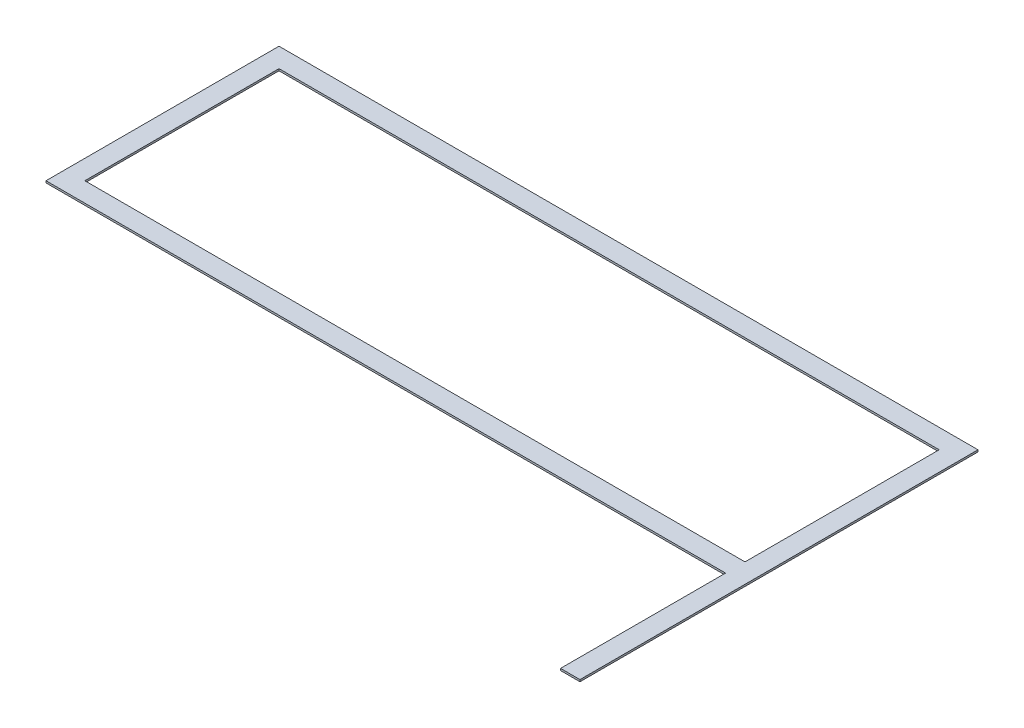
ISO-10303-21;
HEADER;
FILE_DESCRIPTION(('STEP AP214'),'2;1');
FILE_NAME('part.step','',(''),(''),'','','');
FILE_SCHEMA(('AUTOMOTIVE_DESIGN { 1 0 10303 214 1 1 1 1 }'));
ENDSEC;
DATA;
#1=APPLICATION_CONTEXT('core data for automotive mechanical design processes');
#2=APPLICATION_PROTOCOL_DEFINITION('international standard','automotive_design',2000,#1);
#3=PRODUCT_CONTEXT('',#1,'mechanical');
#4=PRODUCT('Part','Part','',(#3));
#5=PRODUCT_RELATED_PRODUCT_CATEGORY('part','',(#4));
#6=PRODUCT_DEFINITION_FORMATION('','',#4);
#7=PRODUCT_DEFINITION_CONTEXT('part definition',#1,'design');
#8=PRODUCT_DEFINITION('design','',#6,#7);
#9=PRODUCT_DEFINITION_SHAPE('','',#8);
#10=(LENGTH_UNIT() NAMED_UNIT(*) SI_UNIT(.MILLI.,.METRE.));
#11=(NAMED_UNIT(*) PLANE_ANGLE_UNIT() SI_UNIT($,.RADIAN.));
#12=(NAMED_UNIT(*) SI_UNIT($,.STERADIAN.) SOLID_ANGLE_UNIT());
#13=UNCERTAINTY_MEASURE_WITH_UNIT(LENGTH_MEASURE(1.E-05),#10,'distance_accuracy_value','');
#14=(GEOMETRIC_REPRESENTATION_CONTEXT(3) GLOBAL_UNCERTAINTY_ASSIGNED_CONTEXT((#13)) GLOBAL_UNIT_ASSIGNED_CONTEXT((#10,
#11,#12)) REPRESENTATION_CONTEXT('',''));
#15=CARTESIAN_POINT('',(0.,0.,0.));
#16=DIRECTION('',(0.,0.,1.));
#17=DIRECTION('',(1.,0.,0.));
#18=AXIS2_PLACEMENT_3D('',#15,#16,#17);
#19=CARTESIAN_POINT('',(0.,5.0038,0.));
#20=DIRECTION('',(0.,1.,0.));
#21=DIRECTION('',(0.,0.,1.));
#22=AXIS2_PLACEMENT_3D('',#19,#20,#21);
#23=PLANE('',#22);
#24=DIRECTION('',(0.,0.,-1.));
#25=VECTOR('',#24,1.);
#26=CARTESIAN_POINT('',(-863.6,5.0038,254.));
#27=LINE('',#26,#25);
#28=CARTESIAN_POINT('',(-863.6,5.0038,-254.));
#29=VERTEX_POINT('',#28);
#30=CARTESIAN_POINT('',(-863.6,5.0038,254.));
#31=VERTEX_POINT('',#30);
#32=EDGE_CURVE('E141',#29,#31,#27,.F.);
#33=ORIENTED_EDGE('',*,*,#32,.F.);
#34=DIRECTION('',(1.,0.,0.));
#35=VECTOR('',#34,1.);
#36=CARTESIAN_POINT('',(-863.6,5.0038,-254.));
#37=LINE('',#36,#35);
#38=CARTESIAN_POINT('',(863.6,5.0038,-254.));
#39=VERTEX_POINT('',#38);
#40=EDGE_CURVE('E128',#39,#29,#37,.F.);
#41=ORIENTED_EDGE('',*,*,#40,.F.);
#42=DIRECTION('',(0.,0.,1.));
#43=VECTOR('',#42,1.);
#44=CARTESIAN_POINT('',(863.6,5.0038,-254.));
#45=LINE('',#44,#43);
#46=CARTESIAN_POINT('',(863.6,5.0038,254.));
#47=VERTEX_POINT('',#46);
#48=EDGE_CURVE('E130',#47,#39,#45,.F.);
#49=ORIENTED_EDGE('',*,*,#48,.F.);
#50=DIRECTION('',(-1.,0.,0.));
#51=VECTOR('',#50,1.);
#52=CARTESIAN_POINT('',(863.6,5.0038,254.));
#53=LINE('',#52,#51);
#54=EDGE_CURVE('E134',#31,#47,#53,.F.);
#55=ORIENTED_EDGE('',*,*,#54,.F.);
#56=EDGE_LOOP('',(#33,#41,#49,#55));
#57=FACE_BOUND('',#56,.T.);
#58=DIRECTION('',(1.,0.,0.));
#59=VECTOR('',#58,1.);
#60=CARTESIAN_POINT('',(0.,5.0038,736.6));
#61=LINE('',#60,#59);
#62=CARTESIAN_POINT('',(914.4,5.0038,736.6));
#63=VERTEX_POINT('',#62);
#64=CARTESIAN_POINT('',(863.6,5.0038,736.6));
#65=VERTEX_POINT('',#64);
#66=EDGE_CURVE('E111',#63,#65,#61,.F.);
#67=ORIENTED_EDGE('',*,*,#66,.F.);
#68=DIRECTION('',(0.,0.,-1.));
#69=VECTOR('',#68,1.);
#70=CARTESIAN_POINT('',(914.4,5.0038,304.8));
#71=LINE('',#70,#69);
#72=CARTESIAN_POINT('',(914.4,5.0038,-304.8));
#73=VERTEX_POINT('',#72);
#74=EDGE_CURVE('E115',#73,#63,#71,.F.);
#75=ORIENTED_EDGE('',*,*,#74,.F.);
#76=DIRECTION('',(-1.,0.,0.));
#77=VECTOR('',#76,1.);
#78=CARTESIAN_POINT('',(914.4,5.0038,-304.8));
#79=LINE('',#78,#77);
#80=CARTESIAN_POINT('',(-914.4,5.0038,-304.8));
#81=VERTEX_POINT('',#80);
#82=EDGE_CURVE('E119',#81,#73,#79,.F.);
#83=ORIENTED_EDGE('',*,*,#82,.F.);
#84=DIRECTION('',(0.,0.,1.));
#85=VECTOR('',#84,1.);
#86=CARTESIAN_POINT('',(-914.4,5.0038,-304.8));
#87=LINE('',#86,#85);
#88=CARTESIAN_POINT('',(-914.4,5.0038,304.8));
#89=VERTEX_POINT('',#88);
#90=EDGE_CURVE('E103',#89,#81,#87,.F.);
#91=ORIENTED_EDGE('',*,*,#90,.F.);
#92=DIRECTION('',(1.,0.,0.));
#93=VECTOR('',#92,1.);
#94=CARTESIAN_POINT('',(-914.4,5.0038,304.8));
#95=LINE('',#94,#93);
#96=CARTESIAN_POINT('',(863.6,5.0038,304.8));
#97=VERTEX_POINT('',#96);
#98=EDGE_CURVE('E20',#97,#89,#95,.F.);
#99=ORIENTED_EDGE('',*,*,#98,.F.);
#100=DIRECTION('',(0.,0.,1.));
#101=VECTOR('',#100,1.);
#102=CARTESIAN_POINT('',(863.6,5.0038,304.8));
#103=LINE('',#102,#101);
#104=EDGE_CURVE('E91',#65,#97,#103,.F.);
#105=ORIENTED_EDGE('',*,*,#104,.F.);
#106=EDGE_LOOP('',(#67,#75,#83,#91,#99,#105));
#107=FACE_BOUND('',#106,.T.);
#108=ADVANCED_FACE('F17',(#57,#107),#23,.T.);
#109=CARTESIAN_POINT('',(-914.4,0.,304.8));
#110=DIRECTION('',(0.,0.,1.));
#111=DIRECTION('',(1.,0.,0.));
#112=AXIS2_PLACEMENT_3D('',#109,#110,#111);
#113=PLANE('',#112);
#114=DIRECTION('',(1.,0.,0.));
#115=VECTOR('',#114,1.);
#116=CARTESIAN_POINT('',(0.,0.,304.8));
#117=LINE('',#116,#115);
#118=CARTESIAN_POINT('',(-914.4,0.,304.8));
#119=VERTEX_POINT('',#118);
#120=CARTESIAN_POINT('',(863.6,0.,304.8));
#121=VERTEX_POINT('',#120);
#122=EDGE_CURVE('E109',#119,#121,#117,.T.);
#123=ORIENTED_EDGE('',*,*,#122,.T.);
#124=DIRECTION('',(0.,1.,0.));
#125=VECTOR('',#124,1.);
#126=CARTESIAN_POINT('',(863.6,5.0038,304.8));
#127=LINE('',#126,#125);
#128=EDGE_CURVE('E98',#97,#121,#127,.F.);
#129=ORIENTED_EDGE('',*,*,#128,.F.);
#130=ORIENTED_EDGE('',*,*,#98,.T.);
#131=DIRECTION('',(0.,1.,0.));
#132=VECTOR('',#131,1.);
#133=CARTESIAN_POINT('',(-914.4,0.,304.8));
#134=LINE('',#133,#132);
#135=EDGE_CURVE('E123',#119,#89,#134,.T.);
#136=ORIENTED_EDGE('',*,*,#135,.F.);
#137=EDGE_LOOP('',(#123,#129,#130,#136));
#138=FACE_BOUND('',#137,.T.);
#139=ADVANCED_FACE('F108',(#138),#113,.T.);
#140=CARTESIAN_POINT('',(863.6,5.0038,304.8));
#141=DIRECTION('',(-1.,0.,0.));
#142=DIRECTION('',(0.,0.,1.));
#143=AXIS2_PLACEMENT_3D('',#140,#141,#142);
#144=PLANE('',#143);
#145=ORIENTED_EDGE('',*,*,#104,.T.);
#146=ORIENTED_EDGE('',*,*,#128,.T.);
#147=DIRECTION('',(0.,0.,1.));
#148=VECTOR('',#147,1.);
#149=CARTESIAN_POINT('',(863.6,0.,0.));
#150=LINE('',#149,#148);
#151=CARTESIAN_POINT('',(863.6,0.,736.6));
#152=VERTEX_POINT('',#151);
#153=EDGE_CURVE('E145',#121,#152,#150,.T.);
#154=ORIENTED_EDGE('',*,*,#153,.T.);
#155=DIRECTION('',(0.,1.,0.));
#156=VECTOR('',#155,1.);
#157=CARTESIAN_POINT('',(863.6,0.,736.6));
#158=LINE('',#157,#156);
#159=EDGE_CURVE('E100',#65,#152,#158,.F.);
#160=ORIENTED_EDGE('',*,*,#159,.F.);
#161=EDGE_LOOP('',(#145,#146,#154,#160));
#162=FACE_BOUND('',#161,.T.);
#163=ADVANCED_FACE('F95',(#162),#144,.T.);
#164=CARTESIAN_POINT('',(0.,0.,736.6));
#165=DIRECTION('',(0.,0.,1.));
#166=DIRECTION('',(1.,0.,0.));
#167=AXIS2_PLACEMENT_3D('',#164,#165,#166);
#168=PLANE('',#167);
#169=DIRECTION('',(0.,1.,0.));
#170=VECTOR('',#169,1.);
#171=CARTESIAN_POINT('',(914.4,0.,736.6));
#172=LINE('',#171,#170);
#173=CARTESIAN_POINT('',(914.4,0.,736.6));
#174=VERTEX_POINT('',#173);
#175=EDGE_CURVE('E117',#63,#174,#172,.F.);
#176=ORIENTED_EDGE('',*,*,#175,.F.);
#177=ORIENTED_EDGE('',*,*,#66,.T.);
#178=ORIENTED_EDGE('',*,*,#159,.T.);
#179=DIRECTION('',(1.,0.,0.));
#180=VECTOR('',#179,1.);
#181=CARTESIAN_POINT('',(0.,0.,736.6));
#182=LINE('',#181,#180);
#183=EDGE_CURVE('E147',#152,#174,#182,.T.);
#184=ORIENTED_EDGE('',*,*,#183,.T.);
#185=EDGE_LOOP('',(#176,#177,#178,#184));
#186=FACE_BOUND('',#185,.T.);
#187=ADVANCED_FACE('F209',(#186),#168,.T.);
#188=CARTESIAN_POINT('',(914.4,0.,304.8));
#189=DIRECTION('',(1.,0.,0.));
#190=DIRECTION('',(0.,0.,-1.));
#191=AXIS2_PLACEMENT_3D('',#188,#189,#190);
#192=PLANE('',#191);
#193=ORIENTED_EDGE('',*,*,#175,.T.);
#194=DIRECTION('',(0.,0.,1.));
#195=VECTOR('',#194,1.);
#196=CARTESIAN_POINT('',(914.4,0.,0.));
#197=LINE('',#196,#195);
#198=CARTESIAN_POINT('',(914.4,0.,-304.8));
#199=VERTEX_POINT('',#198);
#200=EDGE_CURVE('E150',#174,#199,#197,.F.);
#201=ORIENTED_EDGE('',*,*,#200,.T.);
#202=DIRECTION('',(0.,1.,0.));
#203=VECTOR('',#202,1.);
#204=CARTESIAN_POINT('',(914.4,0.,-304.8));
#205=LINE('',#204,#203);
#206=EDGE_CURVE('E121',#73,#199,#205,.F.);
#207=ORIENTED_EDGE('',*,*,#206,.F.);
#208=ORIENTED_EDGE('',*,*,#74,.T.);
#209=EDGE_LOOP('',(#193,#201,#207,#208));
#210=FACE_BOUND('',#209,.T.);
#211=ADVANCED_FACE('F205',(#210),#192,.T.);
#212=CARTESIAN_POINT('',(914.4,0.,-304.8));
#213=DIRECTION('',(0.,0.,-1.));
#214=DIRECTION('',(-1.,0.,0.));
#215=AXIS2_PLACEMENT_3D('',#212,#213,#214);
#216=PLANE('',#215);
#217=ORIENTED_EDGE('',*,*,#206,.T.);
#218=DIRECTION('',(1.,0.,0.));
#219=VECTOR('',#218,1.);
#220=CARTESIAN_POINT('',(0.,0.,-304.8));
#221=LINE('',#220,#219);
#222=CARTESIAN_POINT('',(-914.4,0.,-304.8));
#223=VERTEX_POINT('',#222);
#224=EDGE_CURVE('E153',#199,#223,#221,.F.);
#225=ORIENTED_EDGE('',*,*,#224,.T.);
#226=DIRECTION('',(0.,1.,0.));
#227=VECTOR('',#226,1.);
#228=CARTESIAN_POINT('',(-914.4,0.,-304.8));
#229=LINE('',#228,#227);
#230=EDGE_CURVE('E126',#81,#223,#229,.F.);
#231=ORIENTED_EDGE('',*,*,#230,.F.);
#232=ORIENTED_EDGE('',*,*,#82,.T.);
#233=EDGE_LOOP('',(#217,#225,#231,#232));
#234=FACE_BOUND('',#233,.T.);
#235=ADVANCED_FACE('F201',(#234),#216,.T.);
#236=CARTESIAN_POINT('',(-914.4,0.,-304.8));
#237=DIRECTION('',(-1.,0.,0.));
#238=DIRECTION('',(0.,0.,1.));
#239=AXIS2_PLACEMENT_3D('',#236,#237,#238);
#240=PLANE('',#239);
#241=ORIENTED_EDGE('',*,*,#230,.T.);
#242=DIRECTION('',(0.,0.,1.));
#243=VECTOR('',#242,1.);
#244=CARTESIAN_POINT('',(-914.4,0.,0.));
#245=LINE('',#244,#243);
#246=EDGE_CURVE('E156',#223,#119,#245,.T.);
#247=ORIENTED_EDGE('',*,*,#246,.T.);
#248=ORIENTED_EDGE('',*,*,#135,.T.);
#249=ORIENTED_EDGE('',*,*,#90,.T.);
#250=EDGE_LOOP('',(#241,#247,#248,#249));
#251=FACE_BOUND('',#250,.T.);
#252=ADVANCED_FACE('F198',(#251),#240,.T.);
#253=CARTESIAN_POINT('',(-863.6,0.,-254.));
#254=DIRECTION('',(0.,0.,1.));
#255=DIRECTION('',(1.,0.,0.));
#256=AXIS2_PLACEMENT_3D('',#253,#254,#255);
#257=PLANE('',#256);
#258=DIRECTION('',(0.,1.,0.));
#259=VECTOR('',#258,1.);
#260=CARTESIAN_POINT('',(-863.6,0.,-254.));
#261=LINE('',#260,#259);
#262=CARTESIAN_POINT('',(-863.6,0.,-254.));
#263=VERTEX_POINT('',#262);
#264=EDGE_CURVE('E138',#263,#29,#261,.T.);
#265=ORIENTED_EDGE('',*,*,#264,.F.);
#266=DIRECTION('',(1.,0.,0.));
#267=VECTOR('',#266,1.);
#268=CARTESIAN_POINT('',(0.,0.,-254.));
#269=LINE('',#268,#267);
#270=CARTESIAN_POINT('',(863.6,0.,-254.));
#271=VERTEX_POINT('',#270);
#272=EDGE_CURVE('E159',#263,#271,#269,.T.);
#273=ORIENTED_EDGE('',*,*,#272,.T.);
#274=DIRECTION('',(0.,1.,0.));
#275=VECTOR('',#274,1.);
#276=CARTESIAN_POINT('',(863.6,0.,-254.));
#277=LINE('',#276,#275);
#278=EDGE_CURVE('E132',#39,#271,#277,.F.);
#279=ORIENTED_EDGE('',*,*,#278,.F.);
#280=ORIENTED_EDGE('',*,*,#40,.T.);
#281=EDGE_LOOP('',(#265,#273,#279,#280));
#282=FACE_BOUND('',#281,.T.);
#283=ADVANCED_FACE('F181',(#282),#257,.T.);
#284=CARTESIAN_POINT('',(863.6,0.,-254.));
#285=DIRECTION('',(-1.,0.,0.));
#286=DIRECTION('',(0.,0.,1.));
#287=AXIS2_PLACEMENT_3D('',#284,#285,#286);
#288=PLANE('',#287);
#289=ORIENTED_EDGE('',*,*,#278,.T.);
#290=DIRECTION('',(0.,0.,1.));
#291=VECTOR('',#290,1.);
#292=CARTESIAN_POINT('',(863.6,0.,0.));
#293=LINE('',#292,#291);
#294=CARTESIAN_POINT('',(863.6,0.,254.));
#295=VERTEX_POINT('',#294);
#296=EDGE_CURVE('E162',#271,#295,#293,.T.);
#297=ORIENTED_EDGE('',*,*,#296,.T.);
#298=DIRECTION('',(0.,1.,0.));
#299=VECTOR('',#298,1.);
#300=CARTESIAN_POINT('',(863.6,0.,254.));
#301=LINE('',#300,#299);
#302=EDGE_CURVE('E136',#47,#295,#301,.F.);
#303=ORIENTED_EDGE('',*,*,#302,.F.);
#304=ORIENTED_EDGE('',*,*,#48,.T.);
#305=EDGE_LOOP('',(#289,#297,#303,#304));
#306=FACE_BOUND('',#305,.T.);
#307=ADVANCED_FACE('F175',(#306),#288,.T.);
#308=CARTESIAN_POINT('',(863.6,0.,254.));
#309=DIRECTION('',(0.,0.,-1.));
#310=DIRECTION('',(-1.,0.,0.));
#311=AXIS2_PLACEMENT_3D('',#308,#309,#310);
#312=PLANE('',#311);
#313=ORIENTED_EDGE('',*,*,#302,.T.);
#314=DIRECTION('',(1.,0.,0.));
#315=VECTOR('',#314,1.);
#316=CARTESIAN_POINT('',(0.,0.,254.));
#317=LINE('',#316,#315);
#318=CARTESIAN_POINT('',(-863.6,0.,254.));
#319=VERTEX_POINT('',#318);
#320=EDGE_CURVE('E26',#295,#319,#317,.F.);
#321=ORIENTED_EDGE('',*,*,#320,.T.);
#322=DIRECTION('',(0.,1.,0.));
#323=VECTOR('',#322,1.);
#324=CARTESIAN_POINT('',(-863.6,0.,254.));
#325=LINE('',#324,#323);
#326=EDGE_CURVE('E34',#31,#319,#325,.F.);
#327=ORIENTED_EDGE('',*,*,#326,.F.);
#328=ORIENTED_EDGE('',*,*,#54,.T.);
#329=EDGE_LOOP('',(#313,#321,#327,#328));
#330=FACE_BOUND('',#329,.T.);
#331=ADVANCED_FACE('F168',(#330),#312,.T.);
#332=CARTESIAN_POINT('',(-863.6,0.,254.));
#333=DIRECTION('',(1.,0.,0.));
#334=DIRECTION('',(0.,0.,-1.));
#335=AXIS2_PLACEMENT_3D('',#332,#333,#334);
#336=PLANE('',#335);
#337=ORIENTED_EDGE('',*,*,#326,.T.);
#338=DIRECTION('',(0.,0.,1.));
#339=VECTOR('',#338,1.);
#340=CARTESIAN_POINT('',(-863.6,0.,0.));
#341=LINE('',#340,#339);
#342=EDGE_CURVE('E11',#319,#263,#341,.F.);
#343=ORIENTED_EDGE('',*,*,#342,.T.);
#344=ORIENTED_EDGE('',*,*,#264,.T.);
#345=ORIENTED_EDGE('',*,*,#32,.T.);
#346=EDGE_LOOP('',(#337,#343,#344,#345));
#347=FACE_BOUND('',#346,.T.);
#348=ADVANCED_FACE('F183',(#347),#336,.T.);
#349=CARTESIAN_POINT('',(0.,0.,0.));
#350=DIRECTION('',(0.,1.,0.));
#351=DIRECTION('',(0.,0.,1.));
#352=AXIS2_PLACEMENT_3D('',#349,#350,#351);
#353=PLANE('',#352);
#354=ORIENTED_EDGE('',*,*,#320,.F.);
#355=ORIENTED_EDGE('',*,*,#296,.F.);
#356=ORIENTED_EDGE('',*,*,#272,.F.);
#357=ORIENTED_EDGE('',*,*,#342,.F.);
#358=EDGE_LOOP('',(#354,#355,#356,#357));
#359=FACE_BOUND('',#358,.T.);
#360=ORIENTED_EDGE('',*,*,#224,.F.);
#361=ORIENTED_EDGE('',*,*,#200,.F.);
#362=ORIENTED_EDGE('',*,*,#183,.F.);
#363=ORIENTED_EDGE('',*,*,#153,.F.);
#364=ORIENTED_EDGE('',*,*,#122,.F.);
#365=ORIENTED_EDGE('',*,*,#246,.F.);
#366=EDGE_LOOP('',(#360,#361,#362,#363,#364,#365));
#367=FACE_BOUND('',#366,.T.);
#368=ADVANCED_FACE('F172',(#359,#367),#353,.F.);
#369=CLOSED_SHELL('',(#108,#139,#163,#187,#211,#235,#252,#283,#307,#331,#348,#368));
#370=MANIFOLD_SOLID_BREP('B1',#369);
#371=ADVANCED_BREP_SHAPE_REPRESENTATION('',(#18,#370),#14);
#372=SHAPE_DEFINITION_REPRESENTATION(#9,#371);
ENDSEC;
END-ISO-10303-21;
